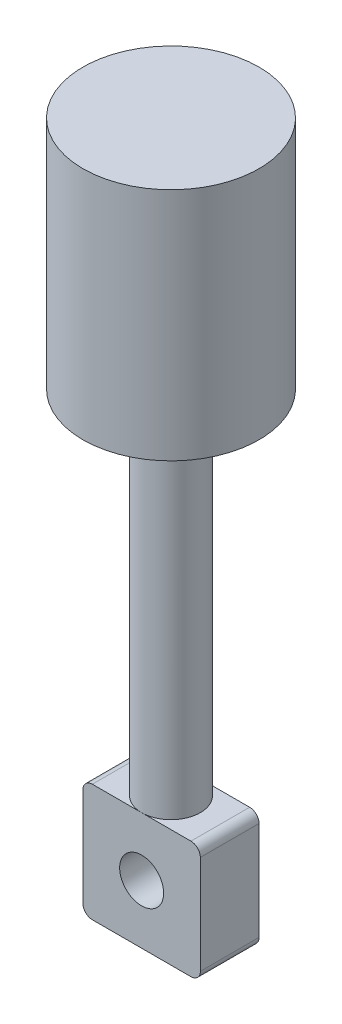
ISO-10303-21;
HEADER;
FILE_DESCRIPTION(('STEP AP214'),'2;1');
FILE_NAME('part.step','',(''),(''),'','','');
FILE_SCHEMA(('AUTOMOTIVE_DESIGN { 1 0 10303 214 1 1 1 1 }'));
ENDSEC;
DATA;
#1=APPLICATION_CONTEXT('core data for automotive mechanical design processes');
#2=APPLICATION_PROTOCOL_DEFINITION('international standard','automotive_design',2000,#1);
#3=PRODUCT_CONTEXT('',#1,'mechanical');
#4=PRODUCT('Part','Part','',(#3));
#5=PRODUCT_RELATED_PRODUCT_CATEGORY('part','',(#4));
#6=PRODUCT_DEFINITION_FORMATION('','',#4);
#7=PRODUCT_DEFINITION_CONTEXT('part definition',#1,'design');
#8=PRODUCT_DEFINITION('design','',#6,#7);
#9=PRODUCT_DEFINITION_SHAPE('','',#8);
#10=(LENGTH_UNIT() NAMED_UNIT(*) SI_UNIT(.MILLI.,.METRE.));
#11=(NAMED_UNIT(*) PLANE_ANGLE_UNIT() SI_UNIT($,.RADIAN.));
#12=(NAMED_UNIT(*) SI_UNIT($,.STERADIAN.) SOLID_ANGLE_UNIT());
#13=UNCERTAINTY_MEASURE_WITH_UNIT(LENGTH_MEASURE(1.E-05),#10,'distance_accuracy_value','');
#14=(GEOMETRIC_REPRESENTATION_CONTEXT(3) GLOBAL_UNCERTAINTY_ASSIGNED_CONTEXT((#13)) GLOBAL_UNIT_ASSIGNED_CONTEXT((#10,
#11,#12)) REPRESENTATION_CONTEXT('',''));
#15=CARTESIAN_POINT('',(0.,0.,0.));
#16=DIRECTION('',(0.,0.,1.));
#17=DIRECTION('',(1.,0.,0.));
#18=AXIS2_PLACEMENT_3D('',#15,#16,#17);
#19=CARTESIAN_POINT('',(1.5875,3.175,1.5875));
#20=DIRECTION('',(0.,-1.,0.));
#21=DIRECTION('',(0.,0.,-1.));
#22=AXIS2_PLACEMENT_3D('',#19,#20,#21);
#23=PLANE('',#22);
#24=CARTESIAN_POINT('',(0.,3.175,0.));
#25=DIRECTION('',(0.,-1.,0.));
#26=DIRECTION('',(0.,0.,-1.));
#27=AXIS2_PLACEMENT_3D('',#24,#25,#26);
#28=CIRCLE('',#27,1.5875);
#29=CARTESIAN_POINT('',(0.,3.175,-1.5875));
#30=VERTEX_POINT('',#29);
#31=CARTESIAN_POINT('',(0.,3.175,1.5875));
#32=VERTEX_POINT('',#31);
#33=EDGE_CURVE('E11',#30,#32,#28,.F.);
#34=ORIENTED_EDGE('',*,*,#33,.F.);
#35=DIRECTION('',(-1.,0.,0.));
#36=VECTOR('',#35,1.);
#37=CARTESIAN_POINT('',(1.5875,3.175,-1.5875));
#38=LINE('',#37,#36);
#39=CARTESIAN_POINT('',(-2.667,3.175,-1.5875));
#40=VERTEX_POINT('',#39);
#41=EDGE_CURVE('E175',#30,#40,#38,.T.);
#42=ORIENTED_EDGE('',*,*,#41,.T.);
#43=DIRECTION('',(0.,0.,-1.));
#44=VECTOR('',#43,1.);
#45=CARTESIAN_POINT('',(-2.667,3.175,1.5875));
#46=LINE('',#45,#44);
#47=CARTESIAN_POINT('',(-2.667,3.175,1.5875));
#48=VERTEX_POINT('',#47);
#49=EDGE_CURVE('E51',#48,#40,#46,.T.);
#50=ORIENTED_EDGE('',*,*,#49,.F.);
#51=DIRECTION('',(-1.,0.,0.));
#52=VECTOR('',#51,1.);
#53=CARTESIAN_POINT('',(-1.5875,3.175,1.5875));
#54=LINE('',#53,#52);
#55=EDGE_CURVE('E105',#32,#48,#54,.T.);
#56=ORIENTED_EDGE('',*,*,#55,.F.);
#57=EDGE_LOOP('',(#34,#42,#50,#56));
#58=FACE_BOUND('',#57,.T.);
#59=ADVANCED_FACE('F42',(#58),#23,.F.);
#60=CARTESIAN_POINT('',(2.667,2.667,1.5875));
#61=DIRECTION('',(0.,0.,-1.));
#62=DIRECTION('',(-1.,0.,0.));
#63=AXIS2_PLACEMENT_3D('',#60,#61,#62);
#64=PLANE('',#63);
#65=CARTESIAN_POINT('',(2.667,3.175,1.5875));
#66=VERTEX_POINT('',#65);
#67=EDGE_CURVE('E64',#66,#32,#54,.T.);
#68=ORIENTED_EDGE('',*,*,#67,.T.);
#69=ORIENTED_EDGE('',*,*,#55,.T.);
#70=CARTESIAN_POINT('',(-2.667,2.667,1.5875));
#71=DIRECTION('',(0.,0.,1.));
#72=DIRECTION('',(1.,0.,0.));
#73=AXIS2_PLACEMENT_3D('',#70,#71,#72);
#74=CIRCLE('',#73,0.508);
#75=CARTESIAN_POINT('',(-3.175,2.667,1.5875));
#76=VERTEX_POINT('',#75);
#77=EDGE_CURVE('E202',#48,#76,#74,.T.);
#78=ORIENTED_EDGE('',*,*,#77,.T.);
#79=DIRECTION('',(0.,-1.,0.));
#80=VECTOR('',#79,1.);
#81=CARTESIAN_POINT('',(-3.175,2.667,1.5875));
#82=LINE('',#81,#80);
#83=CARTESIAN_POINT('',(-3.175,-2.667,1.5875));
#84=VERTEX_POINT('',#83);
#85=EDGE_CURVE('E223',#76,#84,#82,.T.);
#86=ORIENTED_EDGE('',*,*,#85,.T.);
#87=CARTESIAN_POINT('',(-2.667,-2.667,1.5875));
#88=DIRECTION('',(0.,0.,1.));
#89=DIRECTION('',(1.,0.,0.));
#90=AXIS2_PLACEMENT_3D('',#87,#88,#89);
#91=CIRCLE('',#90,0.508);
#92=CARTESIAN_POINT('',(-2.667,-3.175,1.5875));
#93=VERTEX_POINT('',#92);
#94=EDGE_CURVE('E221',#84,#93,#91,.T.);
#95=ORIENTED_EDGE('',*,*,#94,.T.);
#96=DIRECTION('',(1.,0.,0.));
#97=VECTOR('',#96,1.);
#98=CARTESIAN_POINT('',(-2.667,-3.175,1.5875));
#99=LINE('',#98,#97);
#100=CARTESIAN_POINT('',(2.667,-3.175,1.5875));
#101=VERTEX_POINT('',#100);
#102=EDGE_CURVE('E128',#93,#101,#99,.T.);
#103=ORIENTED_EDGE('',*,*,#102,.T.);
#104=CARTESIAN_POINT('',(2.667,-2.667,1.5875));
#105=DIRECTION('',(0.,0.,1.));
#106=DIRECTION('',(1.,0.,0.));
#107=AXIS2_PLACEMENT_3D('',#104,#105,#106);
#108=CIRCLE('',#107,0.508);
#109=CARTESIAN_POINT('',(3.175,-2.667,1.5875));
#110=VERTEX_POINT('',#109);
#111=EDGE_CURVE('E120',#101,#110,#108,.T.);
#112=ORIENTED_EDGE('',*,*,#111,.T.);
#113=DIRECTION('',(0.,1.,0.));
#114=VECTOR('',#113,1.);
#115=CARTESIAN_POINT('',(3.175,2.667,1.5875));
#116=LINE('',#115,#114);
#117=CARTESIAN_POINT('',(3.175,2.667,1.5875));
#118=VERTEX_POINT('',#117);
#119=EDGE_CURVE('E125',#110,#118,#116,.T.);
#120=ORIENTED_EDGE('',*,*,#119,.T.);
#121=CARTESIAN_POINT('',(2.667,2.667,1.5875));
#122=DIRECTION('',(0.,0.,1.));
#123=DIRECTION('',(-1.,0.,0.));
#124=AXIS2_PLACEMENT_3D('',#121,#122,#123);
#125=CIRCLE('',#124,0.508);
#126=EDGE_CURVE('E148',#118,#66,#125,.T.);
#127=ORIENTED_EDGE('',*,*,#126,.T.);
#128=EDGE_LOOP('',(#68,#69,#78,#86,#95,#103,#112,#120,#127));
#129=FACE_BOUND('',#128,.T.);
#130=CARTESIAN_POINT('',(0.,0.,1.5875));
#131=DIRECTION('',(0.,0.,1.));
#132=DIRECTION('',(1.,0.,0.));
#133=AXIS2_PLACEMENT_3D('',#130,#131,#132);
#134=CIRCLE('',#133,1.190625);
#135=CARTESIAN_POINT('',(1.190625,0.,1.5875));
#136=VERTEX_POINT('',#135);
#137=EDGE_CURVE('E159',#136,#136,#134,.T.);
#138=ORIENTED_EDGE('',*,*,#137,.F.);
#139=EDGE_LOOP('',(#138));
#140=FACE_BOUND('',#139,.T.);
#141=ADVANCED_FACE('F122',(#129,#140),#64,.F.);
#142=CARTESIAN_POINT('',(2.667,2.667,-1.5875));
#143=DIRECTION('',(0.,0.,-1.));
#144=DIRECTION('',(-1.,0.,0.));
#145=AXIS2_PLACEMENT_3D('',#142,#143,#144);
#146=PLANE('',#145);
#147=CARTESIAN_POINT('',(-2.667,2.667,-1.5875));
#148=DIRECTION('',(0.,0.,1.));
#149=DIRECTION('',(1.,0.,0.));
#150=AXIS2_PLACEMENT_3D('',#147,#148,#149);
#151=CIRCLE('',#150,0.508);
#152=CARTESIAN_POINT('',(-3.175,2.667,-1.5875));
#153=VERTEX_POINT('',#152);
#154=EDGE_CURVE('E155',#40,#153,#151,.T.);
#155=ORIENTED_EDGE('',*,*,#154,.F.);
#156=ORIENTED_EDGE('',*,*,#41,.F.);
#157=CARTESIAN_POINT('',(2.667,3.175,-1.5875));
#158=VERTEX_POINT('',#157);
#159=EDGE_CURVE('E176',#158,#30,#38,.T.);
#160=ORIENTED_EDGE('',*,*,#159,.F.);
#161=CARTESIAN_POINT('',(2.667,2.667,-1.5875));
#162=DIRECTION('',(0.,0.,1.));
#163=DIRECTION('',(-1.,0.,0.));
#164=AXIS2_PLACEMENT_3D('',#161,#162,#163);
#165=CIRCLE('',#164,0.508);
#166=CARTESIAN_POINT('',(3.175,2.667,-1.5875));
#167=VERTEX_POINT('',#166);
#168=EDGE_CURVE('E99',#167,#158,#165,.T.);
#169=ORIENTED_EDGE('',*,*,#168,.F.);
#170=DIRECTION('',(0.,1.,0.));
#171=VECTOR('',#170,1.);
#172=CARTESIAN_POINT('',(3.175,2.667,-1.5875));
#173=LINE('',#172,#171);
#174=CARTESIAN_POINT('',(3.175,-2.667,-1.5875));
#175=VERTEX_POINT('',#174);
#176=EDGE_CURVE('E170',#175,#167,#173,.T.);
#177=ORIENTED_EDGE('',*,*,#176,.F.);
#178=CARTESIAN_POINT('',(2.667,-2.667,-1.5875));
#179=DIRECTION('',(0.,0.,1.));
#180=DIRECTION('',(1.,0.,0.));
#181=AXIS2_PLACEMENT_3D('',#178,#179,#180);
#182=CIRCLE('',#181,0.508);
#183=CARTESIAN_POINT('',(2.667,-3.175,-1.5875));
#184=VERTEX_POINT('',#183);
#185=EDGE_CURVE('E138',#184,#175,#182,.T.);
#186=ORIENTED_EDGE('',*,*,#185,.F.);
#187=DIRECTION('',(1.,0.,0.));
#188=VECTOR('',#187,1.);
#189=CARTESIAN_POINT('',(-2.667,-3.175,-1.5875));
#190=LINE('',#189,#188);
#191=CARTESIAN_POINT('',(-2.667,-3.175,-1.5875));
#192=VERTEX_POINT('',#191);
#193=EDGE_CURVE('E165',#192,#184,#190,.T.);
#194=ORIENTED_EDGE('',*,*,#193,.F.);
#195=CARTESIAN_POINT('',(-2.667,-2.667,-1.5875));
#196=DIRECTION('',(0.,0.,1.));
#197=DIRECTION('',(1.,0.,0.));
#198=AXIS2_PLACEMENT_3D('',#195,#196,#197);
#199=CIRCLE('',#198,0.508);
#200=CARTESIAN_POINT('',(-3.175,-2.667,-1.5875));
#201=VERTEX_POINT('',#200);
#202=EDGE_CURVE('E162',#201,#192,#199,.T.);
#203=ORIENTED_EDGE('',*,*,#202,.F.);
#204=DIRECTION('',(0.,-1.,0.));
#205=VECTOR('',#204,1.);
#206=CARTESIAN_POINT('',(-3.175,2.667,-1.5875));
#207=LINE('',#206,#205);
#208=EDGE_CURVE('E158',#153,#201,#207,.T.);
#209=ORIENTED_EDGE('',*,*,#208,.F.);
#210=EDGE_LOOP('',(#155,#156,#160,#169,#177,#186,#194,#203,#209));
#211=FACE_BOUND('',#210,.T.);
#212=CARTESIAN_POINT('',(0.,0.,-1.5875));
#213=DIRECTION('',(0.,0.,1.));
#214=DIRECTION('',(1.,0.,0.));
#215=AXIS2_PLACEMENT_3D('',#212,#213,#214);
#216=CIRCLE('',#215,1.190625);
#217=CARTESIAN_POINT('',(1.190625,0.,-1.5875));
#218=VERTEX_POINT('',#217);
#219=EDGE_CURVE('E233',#218,#218,#216,.T.);
#220=ORIENTED_EDGE('',*,*,#219,.T.);
#221=EDGE_LOOP('',(#220));
#222=FACE_BOUND('',#221,.T.);
#223=ADVANCED_FACE('F207',(#211,#222),#146,.T.);
#224=CARTESIAN_POINT('',(-2.667,2.667,1.5875));
#225=DIRECTION('',(0.,0.,-1.));
#226=DIRECTION('',(-1.,0.,0.));
#227=AXIS2_PLACEMENT_3D('',#224,#225,#226);
#228=CYLINDRICAL_SURFACE('',#227,0.508);
#229=ORIENTED_EDGE('',*,*,#154,.T.);
#230=DIRECTION('',(0.,0.,-1.));
#231=VECTOR('',#230,1.);
#232=CARTESIAN_POINT('',(-3.175,2.667,1.5875));
#233=LINE('',#232,#231);
#234=EDGE_CURVE('E193',#76,#153,#233,.T.);
#235=ORIENTED_EDGE('',*,*,#234,.F.);
#236=ORIENTED_EDGE('',*,*,#77,.F.);
#237=ORIENTED_EDGE('',*,*,#49,.T.);
#238=EDGE_LOOP('',(#229,#235,#236,#237));
#239=FACE_BOUND('',#238,.T.);
#240=ADVANCED_FACE('F44',(#239),#228,.T.);
#241=CARTESIAN_POINT('',(-3.175,2.667,1.5875));
#242=DIRECTION('',(1.,0.,0.));
#243=DIRECTION('',(0.,1.,0.));
#244=AXIS2_PLACEMENT_3D('',#241,#242,#243);
#245=PLANE('',#244);
#246=ORIENTED_EDGE('',*,*,#208,.T.);
#247=DIRECTION('',(0.,0.,-1.));
#248=VECTOR('',#247,1.);
#249=CARTESIAN_POINT('',(-3.175,-2.667,1.5875));
#250=LINE('',#249,#248);
#251=EDGE_CURVE('E189',#84,#201,#250,.T.);
#252=ORIENTED_EDGE('',*,*,#251,.F.);
#253=ORIENTED_EDGE('',*,*,#85,.F.);
#254=ORIENTED_EDGE('',*,*,#234,.T.);
#255=EDGE_LOOP('',(#246,#252,#253,#254));
#256=FACE_BOUND('',#255,.T.);
#257=ADVANCED_FACE('F215',(#256),#245,.F.);
#258=CARTESIAN_POINT('',(-2.667,-2.667,1.5875));
#259=DIRECTION('',(0.,0.,-1.));
#260=DIRECTION('',(-1.,0.,0.));
#261=AXIS2_PLACEMENT_3D('',#258,#259,#260);
#262=CYLINDRICAL_SURFACE('',#261,0.508);
#263=ORIENTED_EDGE('',*,*,#202,.T.);
#264=DIRECTION('',(0.,0.,-1.));
#265=VECTOR('',#264,1.);
#266=CARTESIAN_POINT('',(-2.667,-3.175,1.5875));
#267=LINE('',#266,#265);
#268=EDGE_CURVE('E185',#93,#192,#267,.T.);
#269=ORIENTED_EDGE('',*,*,#268,.F.);
#270=ORIENTED_EDGE('',*,*,#94,.F.);
#271=ORIENTED_EDGE('',*,*,#251,.T.);
#272=EDGE_LOOP('',(#263,#269,#270,#271));
#273=FACE_BOUND('',#272,.T.);
#274=ADVANCED_FACE('F219',(#273),#262,.T.);
#275=CARTESIAN_POINT('',(-2.667,-3.175,1.5875));
#276=DIRECTION('',(0.,1.,0.));
#277=DIRECTION('',(0.,0.,1.));
#278=AXIS2_PLACEMENT_3D('',#275,#276,#277);
#279=PLANE('',#278);
#280=ORIENTED_EDGE('',*,*,#193,.T.);
#281=DIRECTION('',(0.,0.,-1.));
#282=VECTOR('',#281,1.);
#283=CARTESIAN_POINT('',(2.667,-3.175,1.5875));
#284=LINE('',#283,#282);
#285=EDGE_CURVE('E142',#101,#184,#284,.T.);
#286=ORIENTED_EDGE('',*,*,#285,.F.);
#287=ORIENTED_EDGE('',*,*,#102,.F.);
#288=ORIENTED_EDGE('',*,*,#268,.T.);
#289=EDGE_LOOP('',(#280,#286,#287,#288));
#290=FACE_BOUND('',#289,.T.);
#291=ADVANCED_FACE('F297',(#290),#279,.F.);
#292=CARTESIAN_POINT('',(2.667,-2.667,1.5875));
#293=DIRECTION('',(0.,0.,-1.));
#294=DIRECTION('',(-1.,0.,0.));
#295=AXIS2_PLACEMENT_3D('',#292,#293,#294);
#296=CYLINDRICAL_SURFACE('',#295,0.508);
#297=ORIENTED_EDGE('',*,*,#185,.T.);
#298=DIRECTION('',(0.,0.,-1.));
#299=VECTOR('',#298,1.);
#300=CARTESIAN_POINT('',(3.175,-2.667,1.5875));
#301=LINE('',#300,#299);
#302=EDGE_CURVE('E135',#110,#175,#301,.T.);
#303=ORIENTED_EDGE('',*,*,#302,.F.);
#304=ORIENTED_EDGE('',*,*,#111,.F.);
#305=ORIENTED_EDGE('',*,*,#285,.T.);
#306=EDGE_LOOP('',(#297,#303,#304,#305));
#307=FACE_BOUND('',#306,.T.);
#308=ADVANCED_FACE('F136',(#307),#296,.T.);
#309=CARTESIAN_POINT('',(3.175,2.667,1.5875));
#310=DIRECTION('',(-1.,0.,0.));
#311=DIRECTION('',(0.,-1.,0.));
#312=AXIS2_PLACEMENT_3D('',#309,#310,#311);
#313=PLANE('',#312);
#314=ORIENTED_EDGE('',*,*,#176,.T.);
#315=DIRECTION('',(0.,0.,-1.));
#316=VECTOR('',#315,1.);
#317=CARTESIAN_POINT('',(3.175,2.667,1.5875));
#318=LINE('',#317,#316);
#319=EDGE_CURVE('E143',#118,#167,#318,.T.);
#320=ORIENTED_EDGE('',*,*,#319,.F.);
#321=ORIENTED_EDGE('',*,*,#119,.F.);
#322=ORIENTED_EDGE('',*,*,#302,.T.);
#323=EDGE_LOOP('',(#314,#320,#321,#322));
#324=FACE_BOUND('',#323,.T.);
#325=ADVANCED_FACE('F145',(#324),#313,.F.);
#326=CARTESIAN_POINT('',(2.667,2.667,1.5875));
#327=DIRECTION('',(0.,0.,-1.));
#328=DIRECTION('',(-1.,0.,0.));
#329=AXIS2_PLACEMENT_3D('',#326,#327,#328);
#330=CYLINDRICAL_SURFACE('',#329,0.508);
#331=ORIENTED_EDGE('',*,*,#168,.T.);
#332=DIRECTION('',(0.,0.,-1.));
#333=VECTOR('',#332,1.);
#334=CARTESIAN_POINT('',(2.667,3.175,1.5875));
#335=LINE('',#334,#333);
#336=EDGE_CURVE('E151',#66,#158,#335,.T.);
#337=ORIENTED_EDGE('',*,*,#336,.F.);
#338=ORIENTED_EDGE('',*,*,#126,.F.);
#339=ORIENTED_EDGE('',*,*,#319,.T.);
#340=EDGE_LOOP('',(#331,#337,#338,#339));
#341=FACE_BOUND('',#340,.T.);
#342=ADVANCED_FACE('F283',(#341),#330,.T.);
#343=CARTESIAN_POINT('',(0.,3.175,0.));
#344=DIRECTION('',(0.,1.,0.));
#345=DIRECTION('',(0.,0.,1.));
#346=AXIS2_PLACEMENT_3D('',#343,#344,#345);
#347=CIRCLE('',#346,1.5875);
#348=EDGE_CURVE('E58',#32,#30,#347,.T.);
#349=ORIENTED_EDGE('',*,*,#348,.F.);
#350=ORIENTED_EDGE('',*,*,#67,.F.);
#351=ORIENTED_EDGE('',*,*,#336,.T.);
#352=ORIENTED_EDGE('',*,*,#159,.T.);
#353=EDGE_LOOP('',(#349,#350,#351,#352));
#354=FACE_BOUND('',#353,.T.);
#355=ADVANCED_FACE('F274',(#354),#23,.F.);
#356=CARTESIAN_POINT('',(0.,0.,1.5875));
#357=DIRECTION('',(0.,0.,-1.));
#358=DIRECTION('',(-1.,0.,0.));
#359=AXIS2_PLACEMENT_3D('',#356,#357,#358);
#360=CYLINDRICAL_SURFACE('',#359,1.190625);
#361=ORIENTED_EDGE('',*,*,#137,.T.);
#362=EDGE_LOOP('',(#361));
#363=FACE_BOUND('',#362,.T.);
#364=ORIENTED_EDGE('',*,*,#219,.F.);
#365=EDGE_LOOP('',(#364));
#366=FACE_BOUND('',#365,.T.);
#367=ADVANCED_FACE('F282',(#363,#366),#360,.F.);
#368=CARTESIAN_POINT('',(0.,22.225,0.));
#369=DIRECTION('',(0.,-1.,0.));
#370=DIRECTION('',(0.,0.,-1.));
#371=AXIS2_PLACEMENT_3D('',#368,#369,#370);
#372=CYLINDRICAL_SURFACE('',#371,1.5875);
#373=CARTESIAN_POINT('',(0.,22.225,0.));
#374=DIRECTION('',(0.,1.,0.));
#375=DIRECTION('',(0.,0.,1.));
#376=AXIS2_PLACEMENT_3D('',#373,#374,#375);
#377=CIRCLE('',#376,1.5875);
#378=CARTESIAN_POINT('',(0.,22.225,1.5875));
#379=VERTEX_POINT('',#378);
#380=EDGE_CURVE('E237',#379,#379,#377,.T.);
#381=ORIENTED_EDGE('',*,*,#380,.F.);
#382=EDGE_LOOP('',(#381));
#383=FACE_BOUND('',#382,.T.);
#384=ORIENTED_EDGE('',*,*,#348,.T.);
#385=ORIENTED_EDGE('',*,*,#33,.T.);
#386=EDGE_LOOP('',(#384,#385));
#387=FACE_BOUND('',#386,.T.);
#388=ADVANCED_FACE('F260',(#383,#387),#372,.T.);
#389=CARTESIAN_POINT('',(0.,34.925,0.));
#390=DIRECTION('',(0.,-1.,0.));
#391=DIRECTION('',(0.,0.,-1.));
#392=AXIS2_PLACEMENT_3D('',#389,#390,#391);
#393=CYLINDRICAL_SURFACE('',#392,4.7625);
#394=CARTESIAN_POINT('',(0.,34.925,0.));
#395=DIRECTION('',(0.,1.,0.));
#396=DIRECTION('',(0.,0.,1.));
#397=AXIS2_PLACEMENT_3D('',#394,#395,#396);
#398=CIRCLE('',#397,4.7625);
#399=CARTESIAN_POINT('',(0.,34.925,4.7625));
#400=VERTEX_POINT('',#399);
#401=EDGE_CURVE('E243',#400,#400,#398,.T.);
#402=ORIENTED_EDGE('',*,*,#401,.F.);
#403=EDGE_LOOP('',(#402));
#404=FACE_BOUND('',#403,.T.);
#405=CARTESIAN_POINT('',(0.,22.225,0.));
#406=DIRECTION('',(0.,1.,0.));
#407=DIRECTION('',(0.,0.,1.));
#408=AXIS2_PLACEMENT_3D('',#405,#406,#407);
#409=CIRCLE('',#408,4.7625);
#410=CARTESIAN_POINT('',(0.,22.225,4.7625));
#411=VERTEX_POINT('',#410);
#412=EDGE_CURVE('E247',#411,#411,#409,.T.);
#413=ORIENTED_EDGE('',*,*,#412,.T.);
#414=EDGE_LOOP('',(#413));
#415=FACE_BOUND('',#414,.T.);
#416=ADVANCED_FACE('F257',(#404,#415),#393,.T.);
#417=CARTESIAN_POINT('',(0.,34.925,0.));
#418=DIRECTION('',(0.,1.,0.));
#419=DIRECTION('',(0.,0.,1.));
#420=AXIS2_PLACEMENT_3D('',#417,#418,#419);
#421=PLANE('',#420);
#422=ORIENTED_EDGE('',*,*,#401,.T.);
#423=EDGE_LOOP('',(#422));
#424=FACE_BOUND('',#423,.T.);
#425=ADVANCED_FACE('F255',(#424),#421,.T.);
#426=CARTESIAN_POINT('',(0.,22.225,0.));
#427=DIRECTION('',(0.,1.,0.));
#428=DIRECTION('',(0.,0.,1.));
#429=AXIS2_PLACEMENT_3D('',#426,#427,#428);
#430=PLANE('',#429);
#431=ORIENTED_EDGE('',*,*,#380,.T.);
#432=EDGE_LOOP('',(#431));
#433=FACE_BOUND('',#432,.T.);
#434=ORIENTED_EDGE('',*,*,#412,.F.);
#435=EDGE_LOOP('',(#434));
#436=FACE_BOUND('',#435,.T.);
#437=ADVANCED_FACE('F264',(#433,#436),#430,.F.);
#438=CLOSED_SHELL('',(#59,#141,#223,#240,#257,#274,#291,#308,#325,#342,#355,#367,#388,#416,#425,#437));
#439=MANIFOLD_SOLID_BREP('B2',#438);
#440=ADVANCED_BREP_SHAPE_REPRESENTATION('',(#18,#439),#14);
#441=SHAPE_DEFINITION_REPRESENTATION(#9,#440);
ENDSEC;
END-ISO-10303-21;
